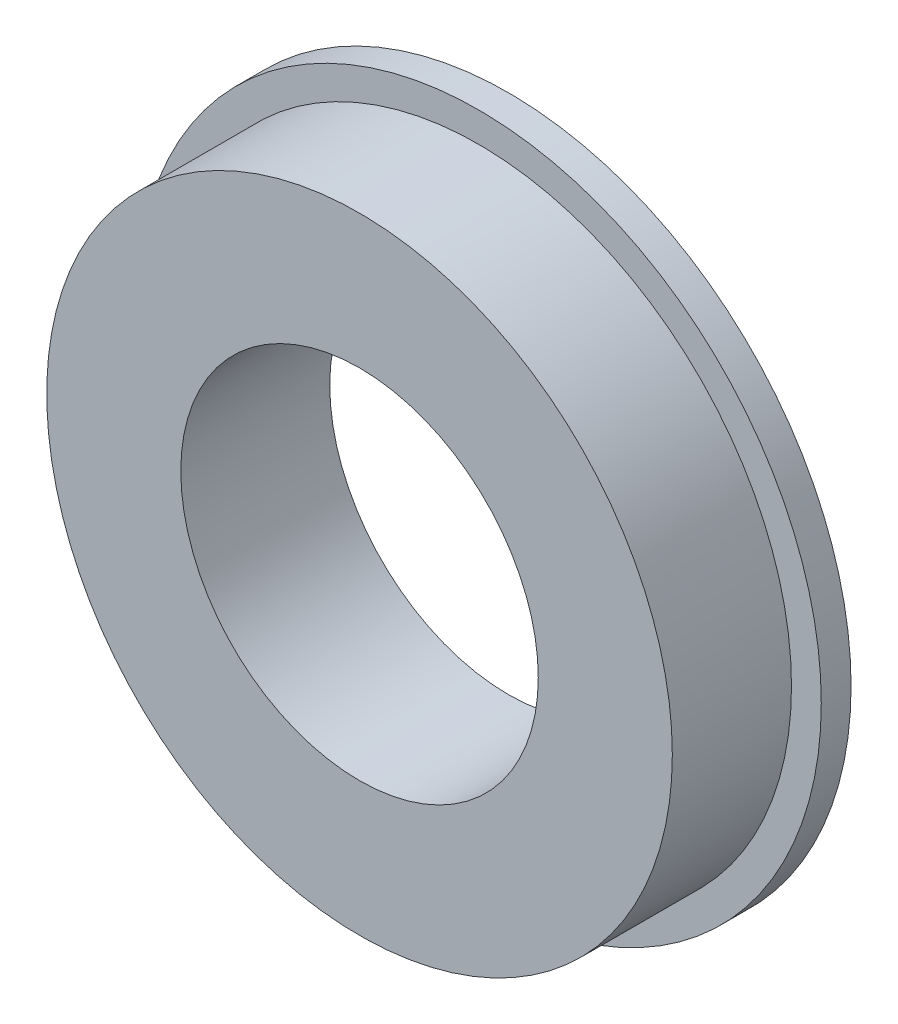
ISO-10303-21;
HEADER;
FILE_DESCRIPTION(('STEP AP214'),'2;1');
FILE_NAME('part.step','',(''),(''),'','','');
FILE_SCHEMA(('AUTOMOTIVE_DESIGN { 1 0 10303 214 1 1 1 1 }'));
ENDSEC;
DATA;
#1=APPLICATION_CONTEXT('core data for automotive mechanical design processes');
#2=APPLICATION_PROTOCOL_DEFINITION('international standard','automotive_design',2000,#1);
#3=PRODUCT_CONTEXT('',#1,'mechanical');
#4=PRODUCT('Part','Part','',(#3));
#5=PRODUCT_RELATED_PRODUCT_CATEGORY('part','',(#4));
#6=PRODUCT_DEFINITION_FORMATION('','',#4);
#7=PRODUCT_DEFINITION_CONTEXT('part definition',#1,'design');
#8=PRODUCT_DEFINITION('design','',#6,#7);
#9=PRODUCT_DEFINITION_SHAPE('','',#8);
#10=(LENGTH_UNIT() NAMED_UNIT(*) SI_UNIT(.MILLI.,.METRE.));
#11=(NAMED_UNIT(*) PLANE_ANGLE_UNIT() SI_UNIT($,.RADIAN.));
#12=(NAMED_UNIT(*) SI_UNIT($,.STERADIAN.) SOLID_ANGLE_UNIT());
#13=UNCERTAINTY_MEASURE_WITH_UNIT(LENGTH_MEASURE(1.E-05),#10,'distance_accuracy_value','');
#14=(GEOMETRIC_REPRESENTATION_CONTEXT(3) GLOBAL_UNCERTAINTY_ASSIGNED_CONTEXT((#13)) GLOBAL_UNIT_ASSIGNED_CONTEXT((#10,
#11,#12)) REPRESENTATION_CONTEXT('',''));
#15=CARTESIAN_POINT('',(0.,0.,0.));
#16=DIRECTION('',(0.,0.,1.));
#17=DIRECTION('',(1.,0.,0.));
#18=AXIS2_PLACEMENT_3D('',#15,#16,#17);
#19=CARTESIAN_POINT('',(0.,0.,1.));
#20=DIRECTION('',(0.,0.,-1.));
#21=DIRECTION('',(-1.,0.,0.));
#22=AXIS2_PLACEMENT_3D('',#19,#20,#21);
#23=CYLINDRICAL_SURFACE('',#22,11.5);
#24=CARTESIAN_POINT('',(0.,0.,1.));
#25=DIRECTION('',(0.,0.,1.));
#26=DIRECTION('',(1.,0.,0.));
#27=AXIS2_PLACEMENT_3D('',#24,#25,#26);
#28=CIRCLE('',#27,11.5);
#29=CARTESIAN_POINT('',(11.5,0.,1.));
#30=VERTEX_POINT('',#29);
#31=EDGE_CURVE('E10',#30,#30,#28,.T.);
#32=ORIENTED_EDGE('',*,*,#31,.F.);
#33=EDGE_LOOP('',(#32));
#34=FACE_BOUND('',#33,.T.);
#35=CARTESIAN_POINT('',(0.,0.,0.));
#36=DIRECTION('',(0.,0.,1.));
#37=DIRECTION('',(1.,0.,0.));
#38=AXIS2_PLACEMENT_3D('',#35,#36,#37);
#39=CIRCLE('',#38,11.5);
#40=CARTESIAN_POINT('',(11.5,0.,0.));
#41=VERTEX_POINT('',#40);
#42=EDGE_CURVE('E35',#41,#41,#39,.T.);
#43=ORIENTED_EDGE('',*,*,#42,.T.);
#44=EDGE_LOOP('',(#43));
#45=FACE_BOUND('',#44,.T.);
#46=ADVANCED_FACE('F32',(#34,#45),#23,.T.);
#47=CARTESIAN_POINT('',(0.,0.,1.));
#48=DIRECTION('',(0.,0.,1.));
#49=DIRECTION('',(1.,0.,0.));
#50=AXIS2_PLACEMENT_3D('',#47,#48,#49);
#51=PLANE('',#50);
#52=CARTESIAN_POINT('',(0.,0.,1.));
#53=DIRECTION('',(0.,0.,1.));
#54=DIRECTION('',(1.,0.,0.));
#55=AXIS2_PLACEMENT_3D('',#52,#53,#54);
#56=CIRCLE('',#55,10.5);
#57=CARTESIAN_POINT('',(10.5,0.,1.));
#58=VERTEX_POINT('',#57);
#59=EDGE_CURVE('E44',#58,#58,#56,.T.);
#60=ORIENTED_EDGE('',*,*,#59,.F.);
#61=EDGE_LOOP('',(#60));
#62=FACE_BOUND('',#61,.T.);
#63=ORIENTED_EDGE('',*,*,#31,.T.);
#64=EDGE_LOOP('',(#63));
#65=FACE_BOUND('',#64,.T.);
#66=ADVANCED_FACE('F77',(#62,#65),#51,.T.);
#67=CARTESIAN_POINT('',(0.,0.,0.));
#68=DIRECTION('',(0.,0.,1.));
#69=DIRECTION('',(1.,0.,0.));
#70=AXIS2_PLACEMENT_3D('',#67,#68,#69);
#71=PLANE('',#70);
#72=CARTESIAN_POINT('',(0.,0.,0.));
#73=DIRECTION('',(0.,0.,1.));
#74=DIRECTION('',(1.,0.,0.));
#75=AXIS2_PLACEMENT_3D('',#72,#73,#74);
#76=CIRCLE('',#75,6.);
#77=CARTESIAN_POINT('',(6.,0.,0.));
#78=VERTEX_POINT('',#77);
#79=EDGE_CURVE('E47',#78,#78,#76,.T.);
#80=ORIENTED_EDGE('',*,*,#79,.T.);
#81=EDGE_LOOP('',(#80));
#82=FACE_BOUND('',#81,.T.);
#83=ORIENTED_EDGE('',*,*,#42,.F.);
#84=EDGE_LOOP('',(#83));
#85=FACE_BOUND('',#84,.T.);
#86=ADVANCED_FACE('F56',(#82,#85),#71,.F.);
#87=CARTESIAN_POINT('',(0.,0.,5.));
#88=DIRECTION('',(0.,0.,-1.));
#89=DIRECTION('',(-1.,0.,0.));
#90=AXIS2_PLACEMENT_3D('',#87,#88,#89);
#91=CYLINDRICAL_SURFACE('',#90,10.5);
#92=CARTESIAN_POINT('',(0.,0.,5.));
#93=DIRECTION('',(0.,0.,1.));
#94=DIRECTION('',(1.,0.,0.));
#95=AXIS2_PLACEMENT_3D('',#92,#93,#94);
#96=CIRCLE('',#95,10.5);
#97=CARTESIAN_POINT('',(10.5,0.,5.));
#98=VERTEX_POINT('',#97);
#99=EDGE_CURVE('E42',#98,#98,#96,.T.);
#100=ORIENTED_EDGE('',*,*,#99,.F.);
#101=EDGE_LOOP('',(#100));
#102=FACE_BOUND('',#101,.T.);
#103=ORIENTED_EDGE('',*,*,#59,.T.);
#104=EDGE_LOOP('',(#103));
#105=FACE_BOUND('',#104,.T.);
#106=ADVANCED_FACE('F68',(#102,#105),#91,.T.);
#107=CARTESIAN_POINT('',(0.,0.,5.));
#108=DIRECTION('',(0.,0.,1.));
#109=DIRECTION('',(1.,0.,0.));
#110=AXIS2_PLACEMENT_3D('',#107,#108,#109);
#111=PLANE('',#110);
#112=CARTESIAN_POINT('',(0.,0.,5.));
#113=DIRECTION('',(0.,0.,1.));
#114=DIRECTION('',(1.,0.,0.));
#115=AXIS2_PLACEMENT_3D('',#112,#113,#114);
#116=CIRCLE('',#115,6.);
#117=CARTESIAN_POINT('',(6.,0.,5.));
#118=VERTEX_POINT('',#117);
#119=EDGE_CURVE('E50',#118,#118,#116,.T.);
#120=ORIENTED_EDGE('',*,*,#119,.F.);
#121=EDGE_LOOP('',(#120));
#122=FACE_BOUND('',#121,.T.);
#123=ORIENTED_EDGE('',*,*,#99,.T.);
#124=EDGE_LOOP('',(#123));
#125=FACE_BOUND('',#124,.T.);
#126=ADVANCED_FACE('F62',(#122,#125),#111,.T.);
#127=CARTESIAN_POINT('',(0.,0.,0.));
#128=DIRECTION('',(0.,0.,1.));
#129=DIRECTION('',(1.,0.,0.));
#130=AXIS2_PLACEMENT_3D('',#127,#128,#129);
#131=CYLINDRICAL_SURFACE('',#130,6.);
#132=ORIENTED_EDGE('',*,*,#79,.F.);
#133=EDGE_LOOP('',(#132));
#134=FACE_BOUND('',#133,.T.);
#135=ORIENTED_EDGE('',*,*,#119,.T.);
#136=EDGE_LOOP('',(#135));
#137=FACE_BOUND('',#136,.T.);
#138=ADVANCED_FACE('F59',(#134,#137),#131,.F.);
#139=CLOSED_SHELL('',(#46,#66,#86,#106,#126,#138));
#140=MANIFOLD_SOLID_BREP('B2',#139);
#141=ADVANCED_BREP_SHAPE_REPRESENTATION('',(#18,#140),#14);
#142=SHAPE_DEFINITION_REPRESENTATION(#9,#141);
ENDSEC;
END-ISO-10303-21;
